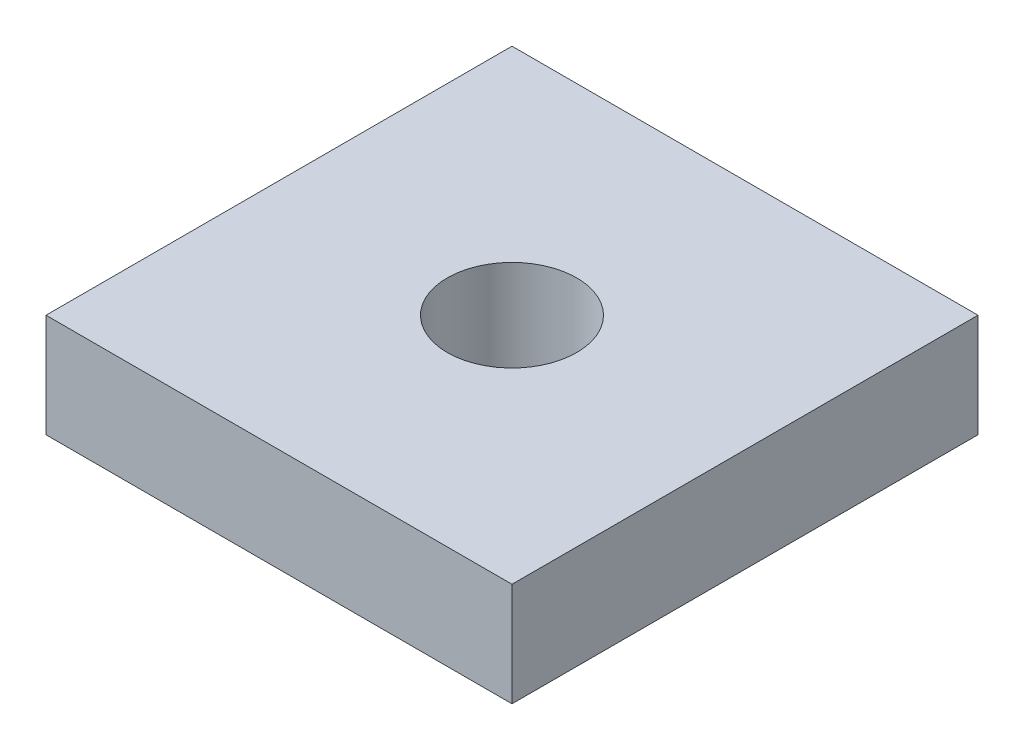
ISO-10303-21;
HEADER;
FILE_DESCRIPTION(('STEP AP214'),'2;1');
FILE_NAME('part.step','',(''),(''),'','','');
FILE_SCHEMA(('AUTOMOTIVE_DESIGN { 1 0 10303 214 1 1 1 1 }'));
ENDSEC;
DATA;
#1=APPLICATION_CONTEXT('core data for automotive mechanical design processes');
#2=APPLICATION_PROTOCOL_DEFINITION('international standard','automotive_design',2000,#1);
#3=PRODUCT_CONTEXT('',#1,'mechanical');
#4=PRODUCT('Part','Part','',(#3));
#5=PRODUCT_RELATED_PRODUCT_CATEGORY('part','',(#4));
#6=PRODUCT_DEFINITION_FORMATION('','',#4);
#7=PRODUCT_DEFINITION_CONTEXT('part definition',#1,'design');
#8=PRODUCT_DEFINITION('design','',#6,#7);
#9=PRODUCT_DEFINITION_SHAPE('','',#8);
#10=(LENGTH_UNIT() NAMED_UNIT(*) SI_UNIT(.MILLI.,.METRE.));
#11=(NAMED_UNIT(*) PLANE_ANGLE_UNIT() SI_UNIT($,.RADIAN.));
#12=(NAMED_UNIT(*) SI_UNIT($,.STERADIAN.) SOLID_ANGLE_UNIT());
#13=UNCERTAINTY_MEASURE_WITH_UNIT(LENGTH_MEASURE(1.E-05),#10,'distance_accuracy_value','');
#14=(GEOMETRIC_REPRESENTATION_CONTEXT(3) GLOBAL_UNCERTAINTY_ASSIGNED_CONTEXT((#13)) GLOBAL_UNIT_ASSIGNED_CONTEXT((#10,
#11,#12)) REPRESENTATION_CONTEXT('',''));
#15=CARTESIAN_POINT('',(0.,0.,0.));
#16=DIRECTION('',(0.,0.,1.));
#17=DIRECTION('',(1.,0.,0.));
#18=AXIS2_PLACEMENT_3D('',#15,#16,#17);
#19=CARTESIAN_POINT('',(-9.,2.,-9.));
#20=DIRECTION('',(1.,0.,0.));
#21=DIRECTION('',(0.,0.,-1.));
#22=AXIS2_PLACEMENT_3D('',#19,#20,#21);
#23=PLANE('',#22);
#24=DIRECTION('',(0.,0.,1.));
#25=VECTOR('',#24,1.);
#26=CARTESIAN_POINT('',(-9.,-2.,-9.));
#27=LINE('',#26,#25);
#28=CARTESIAN_POINT('',(-9.,-2.,-9.));
#29=VERTEX_POINT('',#28);
#30=CARTESIAN_POINT('',(-9.,-2.,9.));
#31=VERTEX_POINT('',#30);
#32=EDGE_CURVE('E79',#29,#31,#27,.T.);
#33=ORIENTED_EDGE('',*,*,#32,.T.);
#34=DIRECTION('',(0.,-1.,0.));
#35=VECTOR('',#34,1.);
#36=CARTESIAN_POINT('',(-9.,2.,9.));
#37=LINE('',#36,#35);
#38=CARTESIAN_POINT('',(-9.,2.,9.));
#39=VERTEX_POINT('',#38);
#40=EDGE_CURVE('E10',#39,#31,#37,.T.);
#41=ORIENTED_EDGE('',*,*,#40,.F.);
#42=DIRECTION('',(0.,0.,1.));
#43=VECTOR('',#42,1.);
#44=CARTESIAN_POINT('',(-9.,2.,-9.));
#45=LINE('',#44,#43);
#46=CARTESIAN_POINT('',(-9.,2.,-9.));
#47=VERTEX_POINT('',#46);
#48=EDGE_CURVE('E67',#47,#39,#45,.T.);
#49=ORIENTED_EDGE('',*,*,#48,.F.);
#50=DIRECTION('',(0.,-1.,0.));
#51=VECTOR('',#50,1.);
#52=CARTESIAN_POINT('',(-9.,2.,-9.));
#53=LINE('',#52,#51);
#54=EDGE_CURVE('E75',#47,#29,#53,.T.);
#55=ORIENTED_EDGE('',*,*,#54,.T.);
#56=EDGE_LOOP('',(#33,#41,#49,#55));
#57=FACE_BOUND('',#56,.T.);
#58=ADVANCED_FACE('F16',(#57),#23,.F.);
#59=CARTESIAN_POINT('',(-9.,2.,9.));
#60=DIRECTION('',(0.,0.,-1.));
#61=DIRECTION('',(-1.,0.,0.));
#62=AXIS2_PLACEMENT_3D('',#59,#60,#61);
#63=PLANE('',#62);
#64=DIRECTION('',(1.,0.,0.));
#65=VECTOR('',#64,1.);
#66=CARTESIAN_POINT('',(-9.,-2.,9.));
#67=LINE('',#66,#65);
#68=CARTESIAN_POINT('',(9.00000000000001,-2.,9.));
#69=VERTEX_POINT('',#68);
#70=EDGE_CURVE('E71',#31,#69,#67,.T.);
#71=ORIENTED_EDGE('',*,*,#70,.T.);
#72=DIRECTION('',(0.,-1.,0.));
#73=VECTOR('',#72,1.);
#74=CARTESIAN_POINT('',(9.00000000000001,2.,9.));
#75=LINE('',#74,#73);
#76=CARTESIAN_POINT('',(9.00000000000001,2.,9.));
#77=VERTEX_POINT('',#76);
#78=EDGE_CURVE('E24',#77,#69,#75,.T.);
#79=ORIENTED_EDGE('',*,*,#78,.F.);
#80=DIRECTION('',(1.,0.,0.));
#81=VECTOR('',#80,1.);
#82=CARTESIAN_POINT('',(-9.,2.,9.));
#83=LINE('',#82,#81);
#84=EDGE_CURVE('E62',#39,#77,#83,.T.);
#85=ORIENTED_EDGE('',*,*,#84,.F.);
#86=ORIENTED_EDGE('',*,*,#40,.T.);
#87=EDGE_LOOP('',(#71,#79,#85,#86));
#88=FACE_BOUND('',#87,.T.);
#89=ADVANCED_FACE('F70',(#88),#63,.F.);
#90=CARTESIAN_POINT('',(9.,2.,-9.));
#91=DIRECTION('',(-1.,0.,0.));
#92=DIRECTION('',(0.,0.,1.));
#93=AXIS2_PLACEMENT_3D('',#90,#91,#92);
#94=PLANE('',#93);
#95=DIRECTION('',(0.,0.,-1.));
#96=VECTOR('',#95,1.);
#97=CARTESIAN_POINT('',(9.,-2.,-9.));
#98=LINE('',#97,#96);
#99=CARTESIAN_POINT('',(9.,-2.,-9.));
#100=VERTEX_POINT('',#99);
#101=EDGE_CURVE('E49',#69,#100,#98,.T.);
#102=ORIENTED_EDGE('',*,*,#101,.T.);
#103=DIRECTION('',(0.,-1.,0.));
#104=VECTOR('',#103,1.);
#105=CARTESIAN_POINT('',(9.,2.,-9.));
#106=LINE('',#105,#104);
#107=CARTESIAN_POINT('',(9.,2.,-9.));
#108=VERTEX_POINT('',#107);
#109=EDGE_CURVE('E72',#108,#100,#106,.T.);
#110=ORIENTED_EDGE('',*,*,#109,.F.);
#111=DIRECTION('',(0.,0.,-1.));
#112=VECTOR('',#111,1.);
#113=CARTESIAN_POINT('',(9.,2.,-9.));
#114=LINE('',#113,#112);
#115=EDGE_CURVE('E65',#77,#108,#114,.T.);
#116=ORIENTED_EDGE('',*,*,#115,.F.);
#117=ORIENTED_EDGE('',*,*,#78,.T.);
#118=EDGE_LOOP('',(#102,#110,#116,#117));
#119=FACE_BOUND('',#118,.T.);
#120=ADVANCED_FACE('F73',(#119),#94,.F.);
#121=CARTESIAN_POINT('',(-9.,2.,-9.));
#122=DIRECTION('',(0.,0.,1.));
#123=DIRECTION('',(1.,0.,0.));
#124=AXIS2_PLACEMENT_3D('',#121,#122,#123);
#125=PLANE('',#124);
#126=DIRECTION('',(-1.,0.,0.));
#127=VECTOR('',#126,1.);
#128=CARTESIAN_POINT('',(-9.,-2.,-9.));
#129=LINE('',#128,#127);
#130=EDGE_CURVE('E55',#100,#29,#129,.T.);
#131=ORIENTED_EDGE('',*,*,#130,.T.);
#132=ORIENTED_EDGE('',*,*,#54,.F.);
#133=DIRECTION('',(-1.,0.,0.));
#134=VECTOR('',#133,1.);
#135=CARTESIAN_POINT('',(-9.,2.,-9.));
#136=LINE('',#135,#134);
#137=EDGE_CURVE('E32',#108,#47,#136,.T.);
#138=ORIENTED_EDGE('',*,*,#137,.F.);
#139=ORIENTED_EDGE('',*,*,#109,.T.);
#140=EDGE_LOOP('',(#131,#132,#138,#139));
#141=FACE_BOUND('',#140,.T.);
#142=ADVANCED_FACE('F87',(#141),#125,.F.);
#143=CARTESIAN_POINT('',(0.,2.,0.));
#144=DIRECTION('',(0.,1.,0.));
#145=DIRECTION('',(0.,0.,1.));
#146=AXIS2_PLACEMENT_3D('',#143,#144,#145);
#147=PLANE('',#146);
#148=CARTESIAN_POINT('',(0.,2.,0.));
#149=DIRECTION('',(0.,1.,0.));
#150=DIRECTION('',(0.,0.,1.));
#151=AXIS2_PLACEMENT_3D('',#148,#149,#150);
#152=CIRCLE('',#151,2.5);
#153=CARTESIAN_POINT('',(0.,2.,2.5));
#154=VERTEX_POINT('',#153);
#155=EDGE_CURVE('E93',#154,#154,#152,.T.);
#156=ORIENTED_EDGE('',*,*,#155,.F.);
#157=EDGE_LOOP('',(#156));
#158=FACE_BOUND('',#157,.T.);
#159=ORIENTED_EDGE('',*,*,#48,.T.);
#160=ORIENTED_EDGE('',*,*,#84,.T.);
#161=ORIENTED_EDGE('',*,*,#115,.T.);
#162=ORIENTED_EDGE('',*,*,#137,.T.);
#163=EDGE_LOOP('',(#159,#160,#161,#162));
#164=FACE_BOUND('',#163,.T.);
#165=ADVANCED_FACE('F63',(#158,#164),#147,.T.);
#166=CARTESIAN_POINT('',(0.,-2.,0.));
#167=DIRECTION('',(0.,1.,0.));
#168=DIRECTION('',(0.,0.,1.));
#169=AXIS2_PLACEMENT_3D('',#166,#167,#168);
#170=PLANE('',#169);
#171=CARTESIAN_POINT('',(0.,-2.,0.));
#172=DIRECTION('',(0.,1.,0.));
#173=DIRECTION('',(0.,0.,1.));
#174=AXIS2_PLACEMENT_3D('',#171,#172,#173);
#175=CIRCLE('',#174,2.5);
#176=CARTESIAN_POINT('',(0.,-2.,2.5));
#177=VERTEX_POINT('',#176);
#178=EDGE_CURVE('E82',#177,#177,#175,.T.);
#179=ORIENTED_EDGE('',*,*,#178,.T.);
#180=EDGE_LOOP('',(#179));
#181=FACE_BOUND('',#180,.T.);
#182=ORIENTED_EDGE('',*,*,#32,.F.);
#183=ORIENTED_EDGE('',*,*,#130,.F.);
#184=ORIENTED_EDGE('',*,*,#101,.F.);
#185=ORIENTED_EDGE('',*,*,#70,.F.);
#186=EDGE_LOOP('',(#182,#183,#184,#185));
#187=FACE_BOUND('',#186,.T.);
#188=ADVANCED_FACE('F90',(#181,#187),#170,.F.);
#189=CARTESIAN_POINT('',(0.,-2.,0.));
#190=DIRECTION('',(0.,1.,0.));
#191=DIRECTION('',(0.,0.,1.));
#192=AXIS2_PLACEMENT_3D('',#189,#190,#191);
#193=CYLINDRICAL_SURFACE('',#192,2.5);
#194=ORIENTED_EDGE('',*,*,#178,.F.);
#195=EDGE_LOOP('',(#194));
#196=FACE_BOUND('',#195,.T.);
#197=ORIENTED_EDGE('',*,*,#155,.T.);
#198=EDGE_LOOP('',(#197));
#199=FACE_BOUND('',#198,.T.);
#200=ADVANCED_FACE('F100',(#196,#199),#193,.F.);
#201=CLOSED_SHELL('',(#58,#89,#120,#142,#165,#188,#200));
#202=MANIFOLD_SOLID_BREP('B1',#201);
#203=ADVANCED_BREP_SHAPE_REPRESENTATION('',(#18,#202),#14);
#204=SHAPE_DEFINITION_REPRESENTATION(#9,#203);
ENDSEC;
END-ISO-10303-21;
